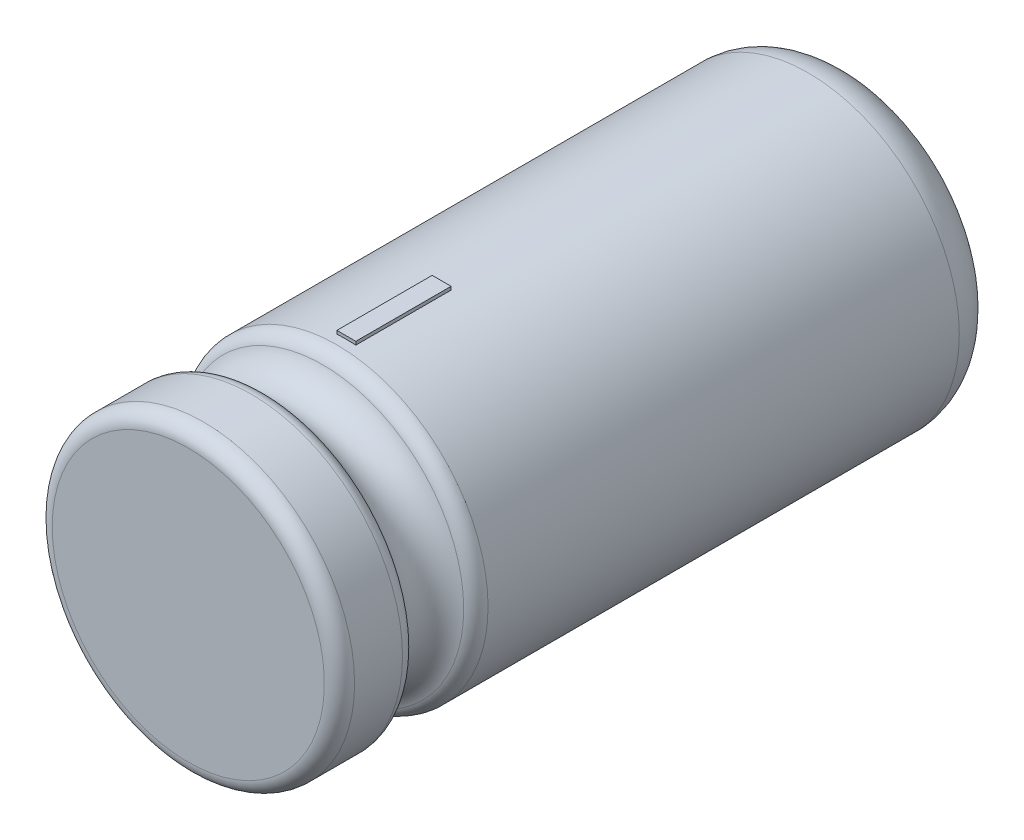
ISO-10303-21;
HEADER;
FILE_DESCRIPTION(('STEP AP214'),'2;1');
FILE_NAME('part.step','',(''),(''),'','','');
FILE_SCHEMA(('AUTOMOTIVE_DESIGN { 1 0 10303 214 1 1 1 1 }'));
ENDSEC;
DATA;
#1=APPLICATION_CONTEXT('core data for automotive mechanical design processes');
#2=APPLICATION_PROTOCOL_DEFINITION('international standard','automotive_design',2000,#1);
#3=PRODUCT_CONTEXT('',#1,'mechanical');
#4=PRODUCT('Part','Part','',(#3));
#5=PRODUCT_RELATED_PRODUCT_CATEGORY('part','',(#4));
#6=PRODUCT_DEFINITION_FORMATION('','',#4);
#7=PRODUCT_DEFINITION_CONTEXT('part definition',#1,'design');
#8=PRODUCT_DEFINITION('design','',#6,#7);
#9=PRODUCT_DEFINITION_SHAPE('','',#8);
#10=(LENGTH_UNIT() NAMED_UNIT(*) SI_UNIT(.MILLI.,.METRE.));
#11=(NAMED_UNIT(*) PLANE_ANGLE_UNIT() SI_UNIT($,.RADIAN.));
#12=(NAMED_UNIT(*) SI_UNIT($,.STERADIAN.) SOLID_ANGLE_UNIT());
#13=UNCERTAINTY_MEASURE_WITH_UNIT(LENGTH_MEASURE(1.E-05),#10,'distance_accuracy_value','');
#14=(GEOMETRIC_REPRESENTATION_CONTEXT(3) GLOBAL_UNCERTAINTY_ASSIGNED_CONTEXT((#13)) GLOBAL_UNIT_ASSIGNED_CONTEXT((#10,
#11,#12)) REPRESENTATION_CONTEXT('',''));
#15=CARTESIAN_POINT('',(0.,0.,0.));
#16=DIRECTION('',(0.,0.,1.));
#17=DIRECTION('',(1.,0.,0.));
#18=AXIS2_PLACEMENT_3D('',#15,#16,#17);
#19=CARTESIAN_POINT('',(0.,0.,0.));
#20=DIRECTION('',(0.,0.,1.));
#21=DIRECTION('',(1.,0.,0.));
#22=AXIS2_PLACEMENT_3D('',#19,#20,#21);
#23=CYLINDRICAL_SURFACE('',#22,2.5);
#24=CARTESIAN_POINT('',(0.,0.,-10.25));
#25=DIRECTION('',(0.,0.,1.));
#26=DIRECTION('',(1.,0.,0.));
#27=AXIS2_PLACEMENT_3D('',#24,#25,#26);
#28=CIRCLE('',#27,2.5);
#29=CARTESIAN_POINT('',(2.5,0.,-10.25));
#30=VERTEX_POINT('',#29);
#31=EDGE_CURVE('E74',#30,#30,#28,.T.);
#32=ORIENTED_EDGE('',*,*,#31,.T.);
#33=EDGE_LOOP('',(#32));
#34=FACE_BOUND('',#33,.T.);
#35=CARTESIAN_POINT('',(0.,0.,-2.45710678118655));
#36=DIRECTION('',(0.,0.,-1.));
#37=DIRECTION('',(-1.,0.,0.));
#38=AXIS2_PLACEMENT_3D('',#35,#36,#37);
#39=CIRCLE('',#38,2.5);
#40=CARTESIAN_POINT('',(-2.5,0.,-2.45710678118655));
#41=VERTEX_POINT('',#40);
#42=EDGE_CURVE('E100',#41,#41,#39,.T.);
#43=ORIENTED_EDGE('',*,*,#42,.T.);
#44=EDGE_LOOP('',(#43));
#45=FACE_BOUND('',#44,.T.);
#46=DIRECTION('',(0.,0.,1.));
#47=VECTOR('',#46,1.);
#48=CARTESIAN_POINT('',(0.156616709446666,2.49508941850229,0.));
#49=LINE('',#48,#47);
#50=CARTESIAN_POINT('',(0.156616709446666,2.49508941850229,-2.6136469209564));
#51=VERTEX_POINT('',#50);
#52=CARTESIAN_POINT('',(0.156616709446666,2.49508941850229,-4.18932644958432));
#53=VERTEX_POINT('',#52);
#54=EDGE_CURVE('E10',#51,#53,#49,.F.);
#55=ORIENTED_EDGE('',*,*,#54,.F.);
#56=CARTESIAN_POINT('',(0.,0.,-2.6136469209564));
#57=DIRECTION('',(0.,0.,-1.));
#58=DIRECTION('',(-1.,0.,0.));
#59=AXIS2_PLACEMENT_3D('',#56,#57,#58);
#60=CIRCLE('',#59,2.5);
#61=CARTESIAN_POINT('',(-0.156616709446666,2.49508941850229,-2.6136469209564));
#62=VERTEX_POINT('',#61);
#63=EDGE_CURVE('E103',#62,#51,#60,.T.);
#64=ORIENTED_EDGE('',*,*,#63,.F.);
#65=DIRECTION('',(0.,0.,1.));
#66=VECTOR('',#65,1.);
#67=CARTESIAN_POINT('',(-0.156616709446666,2.49508941850229,0.));
#68=LINE('',#67,#66);
#69=CARTESIAN_POINT('',(-0.156616709446666,2.49508941850229,-4.18932644958432));
#70=VERTEX_POINT('',#69);
#71=EDGE_CURVE('E34',#70,#62,#68,.T.);
#72=ORIENTED_EDGE('',*,*,#71,.F.);
#73=CARTESIAN_POINT('',(0.,0.,-4.18932644958432));
#74=DIRECTION('',(0.,0.,1.));
#75=DIRECTION('',(1.,0.,0.));
#76=AXIS2_PLACEMENT_3D('',#73,#74,#75);
#77=CIRCLE('',#76,2.5);
#78=EDGE_CURVE('E24',#53,#70,#77,.T.);
#79=ORIENTED_EDGE('',*,*,#78,.F.);
#80=EDGE_LOOP('',(#55,#64,#72,#79));
#81=FACE_BOUND('',#80,.T.);
#82=ADVANCED_FACE('F16',(#34,#45,#81),#23,.T.);
#83=CARTESIAN_POINT('',(0.,0.,-1.75));
#84=DIRECTION('',(0.,0.,1.));
#85=DIRECTION('',(1.,0.,0.));
#86=AXIS2_PLACEMENT_3D('',#83,#84,#85);
#87=TOROIDAL_SURFACE('',#86,2.5,0.5);
#88=CARTESIAN_POINT('',(0.,0.,-1.27859547920897));
#89=DIRECTION('',(0.,0.,-1.));
#90=DIRECTION('',(-1.,0.,0.));
#91=AXIS2_PLACEMENT_3D('',#88,#89,#90);
#92=CIRCLE('',#91,2.33333333333333);
#93=CARTESIAN_POINT('',(-2.33333333333333,0.,-1.27859547920897));
#94=VERTEX_POINT('',#93);
#95=EDGE_CURVE('E97',#94,#94,#92,.T.);
#96=ORIENTED_EDGE('',*,*,#95,.T.);
#97=EDGE_LOOP('',(#96));
#98=FACE_BOUND('',#97,.T.);
#99=CARTESIAN_POINT('',(0.,0.,-2.22140452079104));
#100=DIRECTION('',(0.,0.,1.));
#101=DIRECTION('',(1.,0.,0.));
#102=AXIS2_PLACEMENT_3D('',#99,#100,#101);
#103=CIRCLE('',#102,2.33333333333333);
#104=CARTESIAN_POINT('',(2.33333333333333,0.,-2.22140452079104));
#105=VERTEX_POINT('',#104);
#106=EDGE_CURVE('E94',#105,#105,#103,.T.);
#107=ORIENTED_EDGE('',*,*,#106,.T.);
#108=EDGE_LOOP('',(#107));
#109=FACE_BOUND('',#108,.T.);
#110=ADVANCED_FACE('F117',(#98,#109),#87,.F.);
#111=CARTESIAN_POINT('',(0.,0.,-11.));
#112=DIRECTION('',(0.,0.,1.));
#113=DIRECTION('',(1.,0.,0.));
#114=AXIS2_PLACEMENT_3D('',#111,#112,#113);
#115=PLANE('',#114);
#116=CARTESIAN_POINT('',(0.,0.,-11.));
#117=DIRECTION('',(0.,0.,1.));
#118=DIRECTION('',(1.,0.,0.));
#119=AXIS2_PLACEMENT_3D('',#116,#117,#118);
#120=CIRCLE('',#119,1.75);
#121=CARTESIAN_POINT('',(1.75,0.,-11.));
#122=VERTEX_POINT('',#121);
#123=EDGE_CURVE('E77',#122,#122,#120,.F.);
#124=ORIENTED_EDGE('',*,*,#123,.T.);
#125=EDGE_LOOP('',(#124));
#126=FACE_BOUND('',#125,.T.);
#127=ADVANCED_FACE('F126',(#126),#115,.F.);
#128=CARTESIAN_POINT('',(0.,2.5,0.));
#129=DIRECTION('',(0.,0.,-1.));
#130=DIRECTION('',(-1.,0.,0.));
#131=AXIS2_PLACEMENT_3D('',#128,#129,#130);
#132=PLANE('',#131);
#133=CARTESIAN_POINT('',(0.,0.,0.));
#134=DIRECTION('',(0.,0.,-1.));
#135=DIRECTION('',(-1.,0.,0.));
#136=AXIS2_PLACEMENT_3D('',#133,#134,#135);
#137=CIRCLE('',#136,2.25);
#138=CARTESIAN_POINT('',(-2.25,0.,0.));
#139=VERTEX_POINT('',#138);
#140=EDGE_CURVE('E85',#139,#139,#137,.F.);
#141=ORIENTED_EDGE('',*,*,#140,.T.);
#142=EDGE_LOOP('',(#141));
#143=FACE_BOUND('',#142,.T.);
#144=ADVANCED_FACE('F155',(#143),#132,.F.);
#145=CARTESIAN_POINT('',(0.,0.,0.));
#146=DIRECTION('',(0.,0.,1.));
#147=DIRECTION('',(1.,0.,0.));
#148=AXIS2_PLACEMENT_3D('',#145,#146,#147);
#149=CYLINDRICAL_SURFACE('',#148,2.5);
#150=CARTESIAN_POINT('',(0.,0.,-1.04289321881345));
#151=DIRECTION('',(0.,0.,-1.));
#152=DIRECTION('',(-1.,0.,0.));
#153=AXIS2_PLACEMENT_3D('',#150,#151,#152);
#154=CIRCLE('',#153,2.5);
#155=CARTESIAN_POINT('',(-2.5,0.,-1.04289321881345));
#156=VERTEX_POINT('',#155);
#157=EDGE_CURVE('E91',#156,#156,#154,.F.);
#158=ORIENTED_EDGE('',*,*,#157,.T.);
#159=EDGE_LOOP('',(#158));
#160=FACE_BOUND('',#159,.T.);
#161=CARTESIAN_POINT('',(0.,0.,-0.25));
#162=DIRECTION('',(0.,0.,-1.));
#163=DIRECTION('',(-1.,0.,0.));
#164=AXIS2_PLACEMENT_3D('',#161,#162,#163);
#165=CIRCLE('',#164,2.5);
#166=CARTESIAN_POINT('',(-2.5,0.,-0.25));
#167=VERTEX_POINT('',#166);
#168=EDGE_CURVE('E88',#167,#167,#165,.T.);
#169=ORIENTED_EDGE('',*,*,#168,.T.);
#170=EDGE_LOOP('',(#169));
#171=FACE_BOUND('',#170,.T.);
#172=ADVANCED_FACE('F137',(#160,#171),#149,.T.);
#173=CARTESIAN_POINT('',(0.,0.,-10.25));
#174=DIRECTION('',(0.,0.,1.));
#175=DIRECTION('',(1.,0.,0.));
#176=AXIS2_PLACEMENT_3D('',#173,#174,#175);
#177=TOROIDAL_SURFACE('',#176,1.75,0.75);
#178=ORIENTED_EDGE('',*,*,#123,.F.);
#179=EDGE_LOOP('',(#178));
#180=FACE_BOUND('',#179,.T.);
#181=ORIENTED_EDGE('',*,*,#31,.F.);
#182=EDGE_LOOP('',(#181));
#183=FACE_BOUND('',#182,.T.);
#184=ADVANCED_FACE('F133',(#180,#183),#177,.T.);
#185=CARTESIAN_POINT('',(0.,0.,-0.25));
#186=DIRECTION('',(0.,0.,-1.));
#187=DIRECTION('',(-1.,0.,0.));
#188=AXIS2_PLACEMENT_3D('',#185,#186,#187);
#189=TOROIDAL_SURFACE('',#188,2.25,0.25);
#190=ORIENTED_EDGE('',*,*,#168,.F.);
#191=EDGE_LOOP('',(#190));
#192=FACE_BOUND('',#191,.T.);
#193=ORIENTED_EDGE('',*,*,#140,.F.);
#194=EDGE_LOOP('',(#193));
#195=FACE_BOUND('',#194,.T.);
#196=ADVANCED_FACE('F136',(#192,#195),#189,.T.);
#197=CARTESIAN_POINT('',(0.,0.,-1.04289321881345));
#198=DIRECTION('',(0.,0.,-1.));
#199=DIRECTION('',(-1.,0.,0.));
#200=AXIS2_PLACEMENT_3D('',#197,#198,#199);
#201=TOROIDAL_SURFACE('',#200,2.25,0.25);
#202=ORIENTED_EDGE('',*,*,#95,.F.);
#203=EDGE_LOOP('',(#202));
#204=FACE_BOUND('',#203,.T.);
#205=ORIENTED_EDGE('',*,*,#157,.F.);
#206=EDGE_LOOP('',(#205));
#207=FACE_BOUND('',#206,.T.);
#208=ADVANCED_FACE('F140',(#204,#207),#201,.T.);
#209=CARTESIAN_POINT('',(0.,0.,-2.45710678118655));
#210=DIRECTION('',(0.,0.,-1.));
#211=DIRECTION('',(-1.,0.,0.));
#212=AXIS2_PLACEMENT_3D('',#209,#210,#211);
#213=TOROIDAL_SURFACE('',#212,2.25,0.25);
#214=ORIENTED_EDGE('',*,*,#42,.F.);
#215=EDGE_LOOP('',(#214));
#216=FACE_BOUND('',#215,.T.);
#217=ORIENTED_EDGE('',*,*,#106,.F.);
#218=EDGE_LOOP('',(#217));
#219=FACE_BOUND('',#218,.T.);
#220=ADVANCED_FACE('F18',(#216,#219),#213,.T.);
#221=CARTESIAN_POINT('',(0.156616709446666,2.55,-2.6136469209564));
#222=DIRECTION('',(-1.,0.,0.));
#223=DIRECTION('',(0.,0.,1.));
#224=AXIS2_PLACEMENT_3D('',#221,#222,#223);
#225=PLANE('',#224);
#226=DIRECTION('',(0.,-1.,0.));
#227=VECTOR('',#226,1.);
#228=CARTESIAN_POINT('',(0.156616709446666,2.55,-2.6136469209564));
#229=LINE('',#228,#227);
#230=CARTESIAN_POINT('',(0.156616709446666,2.55,-2.6136469209564));
#231=VERTEX_POINT('',#230);
#232=EDGE_CURVE('E111',#231,#51,#229,.T.);
#233=ORIENTED_EDGE('',*,*,#232,.T.);
#234=ORIENTED_EDGE('',*,*,#54,.T.);
#235=DIRECTION('',(0.,-1.,0.));
#236=VECTOR('',#235,1.);
#237=CARTESIAN_POINT('',(0.156616709446666,2.55,-4.18932644958432));
#238=LINE('',#237,#236);
#239=CARTESIAN_POINT('',(0.156616709446666,2.55,-4.18932644958432));
#240=VERTEX_POINT('',#239);
#241=EDGE_CURVE('E57',#240,#53,#238,.T.);
#242=ORIENTED_EDGE('',*,*,#241,.F.);
#243=DIRECTION('',(0.,0.,-1.));
#244=VECTOR('',#243,1.);
#245=CARTESIAN_POINT('',(0.156616709446666,2.55,-2.6136469209564));
#246=LINE('',#245,#244);
#247=EDGE_CURVE('E63',#231,#240,#246,.T.);
#248=ORIENTED_EDGE('',*,*,#247,.F.);
#249=EDGE_LOOP('',(#233,#234,#242,#248));
#250=FACE_BOUND('',#249,.T.);
#251=ADVANCED_FACE('F73',(#250),#225,.F.);
#252=CARTESIAN_POINT('',(-0.156616709446666,2.55,-2.6136469209564));
#253=DIRECTION('',(1.,0.,0.));
#254=DIRECTION('',(0.,0.,-1.));
#255=AXIS2_PLACEMENT_3D('',#252,#253,#254);
#256=PLANE('',#255);
#257=DIRECTION('',(0.,-1.,0.));
#258=VECTOR('',#257,1.);
#259=CARTESIAN_POINT('',(-0.156616709446666,2.55,-4.18932644958432));
#260=LINE('',#259,#258);
#261=CARTESIAN_POINT('',(-0.156616709446666,2.55,-4.18932644958432));
#262=VERTEX_POINT('',#261);
#263=EDGE_CURVE('E59',#262,#70,#260,.T.);
#264=ORIENTED_EDGE('',*,*,#263,.T.);
#265=ORIENTED_EDGE('',*,*,#71,.T.);
#266=DIRECTION('',(0.,-1.,0.));
#267=VECTOR('',#266,1.);
#268=CARTESIAN_POINT('',(-0.156616709446666,2.55,-2.6136469209564));
#269=LINE('',#268,#267);
#270=CARTESIAN_POINT('',(-0.156616709446666,2.55,-2.6136469209564));
#271=VERTEX_POINT('',#270);
#272=EDGE_CURVE('E79',#271,#62,#269,.T.);
#273=ORIENTED_EDGE('',*,*,#272,.F.);
#274=DIRECTION('',(0.,0.,1.));
#275=VECTOR('',#274,1.);
#276=CARTESIAN_POINT('',(-0.156616709446666,2.55,-2.6136469209564));
#277=LINE('',#276,#275);
#278=EDGE_CURVE('E62',#262,#271,#277,.T.);
#279=ORIENTED_EDGE('',*,*,#278,.F.);
#280=EDGE_LOOP('',(#264,#265,#273,#279));
#281=FACE_BOUND('',#280,.T.);
#282=ADVANCED_FACE('F107',(#281),#256,.F.);
#283=CARTESIAN_POINT('',(-0.156616709446666,2.55,-4.18932644958432));
#284=DIRECTION('',(0.,0.,1.));
#285=DIRECTION('',(1.,0.,0.));
#286=AXIS2_PLACEMENT_3D('',#283,#284,#285);
#287=PLANE('',#286);
#288=ORIENTED_EDGE('',*,*,#241,.T.);
#289=ORIENTED_EDGE('',*,*,#78,.T.);
#290=ORIENTED_EDGE('',*,*,#263,.F.);
#291=DIRECTION('',(-1.,0.,0.));
#292=VECTOR('',#291,1.);
#293=CARTESIAN_POINT('',(-0.156616709446666,2.55,-4.18932644958432));
#294=LINE('',#293,#292);
#295=EDGE_CURVE('E53',#240,#262,#294,.T.);
#296=ORIENTED_EDGE('',*,*,#295,.F.);
#297=EDGE_LOOP('',(#288,#289,#290,#296));
#298=FACE_BOUND('',#297,.T.);
#299=ADVANCED_FACE('F55',(#298),#287,.F.);
#300=CARTESIAN_POINT('',(-0.156616709446666,2.55,-2.6136469209564));
#301=DIRECTION('',(0.,0.,-1.));
#302=DIRECTION('',(-1.,0.,0.));
#303=AXIS2_PLACEMENT_3D('',#300,#301,#302);
#304=PLANE('',#303);
#305=ORIENTED_EDGE('',*,*,#272,.T.);
#306=ORIENTED_EDGE('',*,*,#63,.T.);
#307=ORIENTED_EDGE('',*,*,#232,.F.);
#308=DIRECTION('',(1.,0.,0.));
#309=VECTOR('',#308,1.);
#310=CARTESIAN_POINT('',(-0.156616709446666,2.55,-2.6136469209564));
#311=LINE('',#310,#309);
#312=EDGE_CURVE('E68',#271,#231,#311,.T.);
#313=ORIENTED_EDGE('',*,*,#312,.F.);
#314=EDGE_LOOP('',(#305,#306,#307,#313));
#315=FACE_BOUND('',#314,.T.);
#316=ADVANCED_FACE('F115',(#315),#304,.F.);
#317=CARTESIAN_POINT('',(0.,2.55,0.));
#318=DIRECTION('',(0.,-1.,0.));
#319=DIRECTION('',(0.,0.,-1.));
#320=AXIS2_PLACEMENT_3D('',#317,#318,#319);
#321=PLANE('',#320);
#322=ORIENTED_EDGE('',*,*,#247,.T.);
#323=ORIENTED_EDGE('',*,*,#295,.T.);
#324=ORIENTED_EDGE('',*,*,#278,.T.);
#325=ORIENTED_EDGE('',*,*,#312,.T.);
#326=EDGE_LOOP('',(#322,#323,#324,#325));
#327=FACE_BOUND('',#326,.T.);
#328=ADVANCED_FACE('F66',(#327),#321,.F.);
#329=CLOSED_SHELL('',(#82,#110,#127,#144,#172,#184,#196,#208,#220,#251,#282,#299,#316,#328));
#330=MANIFOLD_SOLID_BREP('B1',#329);
#331=ADVANCED_BREP_SHAPE_REPRESENTATION('',(#18,#330),#14);
#332=SHAPE_DEFINITION_REPRESENTATION(#9,#331);
ENDSEC;
END-ISO-10303-21;
